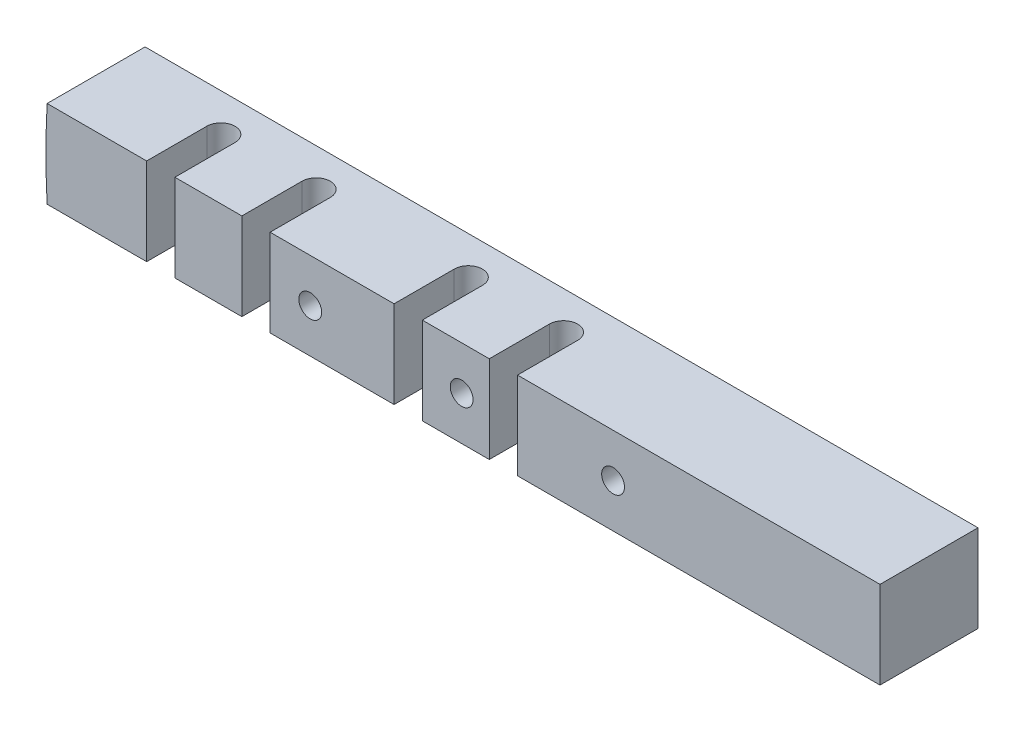
ISO-10303-21;
HEADER;
FILE_DESCRIPTION(('STEP AP214'),'2;1');
FILE_NAME('part.step','',(''),(''),'','','');
FILE_SCHEMA(('AUTOMOTIVE_DESIGN { 1 0 10303 214 1 1 1 1 }'));
ENDSEC;
DATA;
#1=APPLICATION_CONTEXT('core data for automotive mechanical design processes');
#2=APPLICATION_PROTOCOL_DEFINITION('international standard','automotive_design',2000,#1);
#3=PRODUCT_CONTEXT('',#1,'mechanical');
#4=PRODUCT('Part','Part','',(#3));
#5=PRODUCT_RELATED_PRODUCT_CATEGORY('part','',(#4));
#6=PRODUCT_DEFINITION_FORMATION('','',#4);
#7=PRODUCT_DEFINITION_CONTEXT('part definition',#1,'design');
#8=PRODUCT_DEFINITION('design','',#6,#7);
#9=PRODUCT_DEFINITION_SHAPE('','',#8);
#10=(LENGTH_UNIT() NAMED_UNIT(*) SI_UNIT(.MILLI.,.METRE.));
#11=(NAMED_UNIT(*) PLANE_ANGLE_UNIT() SI_UNIT($,.RADIAN.));
#12=(NAMED_UNIT(*) SI_UNIT($,.STERADIAN.) SOLID_ANGLE_UNIT());
#13=UNCERTAINTY_MEASURE_WITH_UNIT(LENGTH_MEASURE(1.E-05),#10,'distance_accuracy_value','');
#14=(GEOMETRIC_REPRESENTATION_CONTEXT(3) GLOBAL_UNCERTAINTY_ASSIGNED_CONTEXT((#13)) GLOBAL_UNIT_ASSIGNED_CONTEXT((#10,
#11,#12)) REPRESENTATION_CONTEXT('',''));
#15=CARTESIAN_POINT('',(0.,0.,0.));
#16=DIRECTION('',(0.,0.,1.));
#17=DIRECTION('',(1.,0.,0.));
#18=AXIS2_PLACEMENT_3D('',#15,#16,#17);
#19=CARTESIAN_POINT('',(7.49808000000001,4.318,13.97));
#20=DIRECTION('',(0.,-1.,0.));
#21=DIRECTION('',(1.,0.,0.));
#22=AXIS2_PLACEMENT_3D('',#19,#20,#21);
#23=PLANE('',#22);
#24=DIRECTION('',(0.,0.,-1.));
#25=VECTOR('',#24,1.);
#26=CARTESIAN_POINT('',(-75.8231481277321,4.31799999999999,13.97));
#27=LINE('',#26,#25);
#28=CARTESIAN_POINT('',(-75.8231481277321,4.31800000000002,9.69747570412176));
#29=VERTEX_POINT('',#28);
#30=CARTESIAN_POINT('',(-75.8231481277321,4.31799999999999,0.));
#31=VERTEX_POINT('',#30);
#32=EDGE_CURVE('E194',#29,#31,#27,.T.);
#33=ORIENTED_EDGE('',*,*,#32,.F.);
#34=DIRECTION('',(1.,0.,0.));
#35=VECTOR('',#34,1.);
#36=CARTESIAN_POINT('',(-87.3381097423243,4.31800000000002,9.69747570412176));
#37=LINE('',#36,#35);
#38=CARTESIAN_POINT('',(-65.97142,4.31800000000002,9.69747570412176));
#39=VERTEX_POINT('',#38);
#40=EDGE_CURVE('E170',#29,#39,#37,.T.);
#41=ORIENTED_EDGE('',*,*,#40,.T.);
#42=DIRECTION('',(0.,0.,-1.));
#43=VECTOR('',#42,1.);
#44=CARTESIAN_POINT('',(-65.97142,4.31800000000001,10.2235));
#45=LINE('',#44,#43);
#46=CARTESIAN_POINT('',(-65.97142,4.31800000000001,3.7465));
#47=VERTEX_POINT('',#46);
#48=EDGE_CURVE('E219',#39,#47,#45,.T.);
#49=ORIENTED_EDGE('',*,*,#48,.T.);
#50=CARTESIAN_POINT('',(-64.57442,4.31800000000001,3.7465));
#51=DIRECTION('',(0.,-1.,0.));
#52=DIRECTION('',(-1.,0.,0.));
#53=AXIS2_PLACEMENT_3D('',#50,#51,#52);
#54=CIRCLE('',#53,1.397);
#55=CARTESIAN_POINT('',(-63.17742,4.31800000000001,3.7465));
#56=VERTEX_POINT('',#55);
#57=EDGE_CURVE('E222',#47,#56,#54,.T.);
#58=ORIENTED_EDGE('',*,*,#57,.T.);
#59=DIRECTION('',(0.,0.,1.));
#60=VECTOR('',#59,1.);
#61=CARTESIAN_POINT('',(-63.17742,4.31800000000001,10.2235));
#62=LINE('',#61,#60);
#63=CARTESIAN_POINT('',(-63.17742,4.31800000000002,9.69747570412176));
#64=VERTEX_POINT('',#63);
#65=EDGE_CURVE('E230',#56,#64,#62,.T.);
#66=ORIENTED_EDGE('',*,*,#65,.T.);
#67=CARTESIAN_POINT('',(-56.54802,4.31800000000002,9.69747570412176));
#68=VERTEX_POINT('',#67);
#69=EDGE_CURVE('E377',#64,#68,#37,.T.);
#70=ORIENTED_EDGE('',*,*,#69,.T.);
#71=DIRECTION('',(0.,0.,-1.));
#72=VECTOR('',#71,1.);
#73=CARTESIAN_POINT('',(-56.54802,4.31800000000001,10.2235));
#74=LINE('',#73,#72);
#75=CARTESIAN_POINT('',(-56.54802,4.31800000000001,3.7465));
#76=VERTEX_POINT('',#75);
#77=EDGE_CURVE('E280',#68,#76,#74,.T.);
#78=ORIENTED_EDGE('',*,*,#77,.T.);
#79=CARTESIAN_POINT('',(-55.15102,4.31800000000001,3.7465));
#80=DIRECTION('',(0.,-1.,0.));
#81=DIRECTION('',(1.,0.,0.));
#82=AXIS2_PLACEMENT_3D('',#79,#80,#81);
#83=CIRCLE('',#82,1.397);
#84=CARTESIAN_POINT('',(-53.75402,4.31800000000001,3.7465));
#85=VERTEX_POINT('',#84);
#86=EDGE_CURVE('E285',#76,#85,#83,.T.);
#87=ORIENTED_EDGE('',*,*,#86,.T.);
#88=DIRECTION('',(0.,0.,1.));
#89=VECTOR('',#88,1.);
#90=CARTESIAN_POINT('',(-53.75402,4.31800000000001,10.2235));
#91=LINE('',#90,#89);
#92=CARTESIAN_POINT('',(-53.75402,4.31800000000001,9.69747570412176));
#93=VERTEX_POINT('',#92);
#94=EDGE_CURVE('E292',#85,#93,#91,.T.);
#95=ORIENTED_EDGE('',*,*,#94,.T.);
#96=CARTESIAN_POINT('',(-41.48582,4.31800000000002,9.69747570412176));
#97=VERTEX_POINT('',#96);
#98=EDGE_CURVE('E375',#93,#97,#37,.T.);
#99=ORIENTED_EDGE('',*,*,#98,.T.);
#100=DIRECTION('',(0.,0.,-1.));
#101=VECTOR('',#100,1.);
#102=CARTESIAN_POINT('',(-41.48582,4.31800000000001,10.2235));
#103=LINE('',#102,#101);
#104=CARTESIAN_POINT('',(-41.48582,4.31800000000001,3.7465));
#105=VERTEX_POINT('',#104);
#106=EDGE_CURVE('E259',#97,#105,#103,.T.);
#107=ORIENTED_EDGE('',*,*,#106,.T.);
#108=CARTESIAN_POINT('',(-40.08882,4.31800000000001,3.7465));
#109=DIRECTION('',(0.,-1.,0.));
#110=DIRECTION('',(-1.,0.,0.));
#111=AXIS2_PLACEMENT_3D('',#108,#109,#110);
#112=CIRCLE('',#111,1.397);
#113=CARTESIAN_POINT('',(-38.69182,4.31800000000001,3.7465));
#114=VERTEX_POINT('',#113);
#115=EDGE_CURVE('E264',#105,#114,#112,.T.);
#116=ORIENTED_EDGE('',*,*,#115,.T.);
#117=DIRECTION('',(0.,0.,1.));
#118=VECTOR('',#117,1.);
#119=CARTESIAN_POINT('',(-38.69182,4.31800000000001,10.2235));
#120=LINE('',#119,#118);
#121=CARTESIAN_POINT('',(-38.69182,4.31800000000001,9.69747570412176));
#122=VERTEX_POINT('',#121);
#123=EDGE_CURVE('E272',#114,#122,#120,.T.);
#124=ORIENTED_EDGE('',*,*,#123,.T.);
#125=CARTESIAN_POINT('',(-32.06242,4.31800000000001,9.69747570412176));
#126=VERTEX_POINT('',#125);
#127=EDGE_CURVE('E55',#122,#126,#37,.T.);
#128=ORIENTED_EDGE('',*,*,#127,.T.);
#129=DIRECTION('',(0.,0.,-1.));
#130=VECTOR('',#129,1.);
#131=CARTESIAN_POINT('',(-32.06242,4.31800000000001,10.2235));
#132=LINE('',#131,#130);
#133=CARTESIAN_POINT('',(-32.06242,4.318,3.7465));
#134=VERTEX_POINT('',#133);
#135=EDGE_CURVE('E243',#126,#134,#132,.T.);
#136=ORIENTED_EDGE('',*,*,#135,.T.);
#137=CARTESIAN_POINT('',(-30.66542,4.318,3.7465));
#138=DIRECTION('',(0.,-1.,0.));
#139=DIRECTION('',(1.,0.,0.));
#140=AXIS2_PLACEMENT_3D('',#137,#138,#139);
#141=CIRCLE('',#140,1.397);
#142=CARTESIAN_POINT('',(-29.26842,4.318,3.7465));
#143=VERTEX_POINT('',#142);
#144=EDGE_CURVE('E252',#134,#143,#141,.T.);
#145=ORIENTED_EDGE('',*,*,#144,.T.);
#146=DIRECTION('',(0.,0.,1.));
#147=VECTOR('',#146,1.);
#148=CARTESIAN_POINT('',(-29.26842,4.318,10.2235));
#149=LINE('',#148,#147);
#150=CARTESIAN_POINT('',(-29.26842,4.31800000000001,9.69747570412176));
#151=VERTEX_POINT('',#150);
#152=EDGE_CURVE('E238',#143,#151,#149,.T.);
#153=ORIENTED_EDGE('',*,*,#152,.T.);
#154=CARTESIAN_POINT('',(6.60400000000001,4.31800000000001,9.69747570412176));
#155=VERTEX_POINT('',#154);
#156=EDGE_CURVE('E186',#151,#155,#37,.T.);
#157=ORIENTED_EDGE('',*,*,#156,.T.);
#158=DIRECTION('',(0.,0.,-1.));
#159=VECTOR('',#158,1.);
#160=CARTESIAN_POINT('',(6.60400000000001,4.31800000000001,13.97));
#161=LINE('',#160,#159);
#162=CARTESIAN_POINT('',(6.60400000000001,4.31800000000001,0.));
#163=VERTEX_POINT('',#162);
#164=EDGE_CURVE('E206',#155,#163,#161,.T.);
#165=ORIENTED_EDGE('',*,*,#164,.T.);
#166=DIRECTION('',(-1.,0.,0.));
#167=VECTOR('',#166,1.);
#168=CARTESIAN_POINT('',(7.49808000000001,4.318,0.));
#169=LINE('',#168,#167);
#170=EDGE_CURVE('E209',#163,#31,#169,.T.);
#171=ORIENTED_EDGE('',*,*,#170,.T.);
#172=EDGE_LOOP('',(#33,#41,#49,#58,#66,#70,#78,#87,#95,#99,#107,#116,#124,#128,#136,#145,#153,
#157,#165,#171));
#173=FACE_BOUND('',#172,.T.);
#174=ADVANCED_FACE('F33',(#173),#23,.F.);
#175=CARTESIAN_POINT('',(0.,0.,13.97));
#176=DIRECTION('',(0.,0.,-1.));
#177=DIRECTION('',(-1.,0.,0.));
#178=AXIS2_PLACEMENT_3D('',#175,#176,#177);
#179=CYLINDRICAL_SURFACE('',#178,75.946);
#180=DIRECTION('',(0.,0.,-1.));
#181=VECTOR('',#180,1.);
#182=CARTESIAN_POINT('',(-75.8231481277321,-4.318,13.97));
#183=LINE('',#182,#181);
#184=CARTESIAN_POINT('',(-75.8231481277321,-4.31799999999999,9.69747570412176));
#185=VERTEX_POINT('',#184);
#186=CARTESIAN_POINT('',(-75.8231481277321,-4.318,0.));
#187=VERTEX_POINT('',#186);
#188=EDGE_CURVE('E182',#185,#187,#183,.T.);
#189=ORIENTED_EDGE('',*,*,#188,.F.);
#190=CARTESIAN_POINT('',(0.,0.,9.69747570412176));
#191=DIRECTION('',(0.,0.,-1.));
#192=DIRECTION('',(-1.,0.,0.));
#193=AXIS2_PLACEMENT_3D('',#190,#191,#192);
#194=CIRCLE('',#193,75.946);
#195=EDGE_CURVE('E167',#185,#29,#194,.T.);
#196=ORIENTED_EDGE('',*,*,#195,.T.);
#197=ORIENTED_EDGE('',*,*,#32,.T.);
#198=CARTESIAN_POINT('',(0.,0.,0.));
#199=DIRECTION('',(0.,0.,1.));
#200=DIRECTION('',(-1.,0.,0.));
#201=AXIS2_PLACEMENT_3D('',#198,#199,#200);
#202=CIRCLE('',#201,75.946);
#203=EDGE_CURVE('E192',#31,#187,#202,.T.);
#204=ORIENTED_EDGE('',*,*,#203,.T.);
#205=EDGE_LOOP('',(#189,#196,#197,#204));
#206=FACE_BOUND('',#205,.T.);
#207=ADVANCED_FACE('F190',(#206),#179,.T.);
#208=CARTESIAN_POINT('',(7.49808000000001,-4.318,13.97));
#209=DIRECTION('',(0.,1.,0.));
#210=DIRECTION('',(-1.,0.,0.));
#211=AXIS2_PLACEMENT_3D('',#208,#209,#210);
#212=PLANE('',#211);
#213=DIRECTION('',(0.,0.,-1.));
#214=VECTOR('',#213,1.);
#215=CARTESIAN_POINT('',(6.60400000000001,-4.318,13.97));
#216=LINE('',#215,#214);
#217=CARTESIAN_POINT('',(6.60400000000001,-4.318,9.69747570412176));
#218=VERTEX_POINT('',#217);
#219=CARTESIAN_POINT('',(6.60400000000001,-4.318,0.));
#220=VERTEX_POINT('',#219);
#221=EDGE_CURVE('E174',#218,#220,#216,.T.);
#222=ORIENTED_EDGE('',*,*,#221,.F.);
#223=DIRECTION('',(1.,0.,0.));
#224=VECTOR('',#223,1.);
#225=CARTESIAN_POINT('',(-87.3381097423243,-4.31799999999999,9.69747570412176));
#226=LINE('',#225,#224);
#227=CARTESIAN_POINT('',(-29.26842,-4.318,9.69747570412176));
#228=VERTEX_POINT('',#227);
#229=EDGE_CURVE('E189',#228,#218,#226,.T.);
#230=ORIENTED_EDGE('',*,*,#229,.F.);
#231=DIRECTION('',(0.,0.,1.));
#232=VECTOR('',#231,1.);
#233=CARTESIAN_POINT('',(-29.26842,-4.31799999999999,10.2235));
#234=LINE('',#233,#232);
#235=CARTESIAN_POINT('',(-29.26842,-4.31799999999999,3.7465));
#236=VERTEX_POINT('',#235);
#237=EDGE_CURVE('E240',#236,#228,#234,.T.);
#238=ORIENTED_EDGE('',*,*,#237,.F.);
#239=CARTESIAN_POINT('',(-30.66542,-4.31799999999999,3.7465));
#240=DIRECTION('',(0.,-1.,0.));
#241=DIRECTION('',(1.,0.,0.));
#242=AXIS2_PLACEMENT_3D('',#239,#240,#241);
#243=CIRCLE('',#242,1.397);
#244=CARTESIAN_POINT('',(-32.06242,-4.31799999999999,3.7465));
#245=VERTEX_POINT('',#244);
#246=EDGE_CURVE('E244',#245,#236,#243,.T.);
#247=ORIENTED_EDGE('',*,*,#246,.F.);
#248=DIRECTION('',(0.,0.,-1.));
#249=VECTOR('',#248,1.);
#250=CARTESIAN_POINT('',(-32.06242,-4.31799999999999,10.2235));
#251=LINE('',#250,#249);
#252=CARTESIAN_POINT('',(-32.06242,-4.318,9.69747570412176));
#253=VERTEX_POINT('',#252);
#254=EDGE_CURVE('E247',#253,#245,#251,.T.);
#255=ORIENTED_EDGE('',*,*,#254,.F.);
#256=CARTESIAN_POINT('',(-38.69182,-4.31799999999999,9.69747570412176));
#257=VERTEX_POINT('',#256);
#258=EDGE_CURVE('E320',#257,#253,#226,.T.);
#259=ORIENTED_EDGE('',*,*,#258,.F.);
#260=DIRECTION('',(0.,0.,1.));
#261=VECTOR('',#260,1.);
#262=CARTESIAN_POINT('',(-38.69182,-4.31799999999999,10.2235));
#263=LINE('',#262,#261);
#264=CARTESIAN_POINT('',(-38.69182,-4.31799999999999,3.7465));
#265=VERTEX_POINT('',#264);
#266=EDGE_CURVE('E265',#265,#257,#263,.T.);
#267=ORIENTED_EDGE('',*,*,#266,.F.);
#268=CARTESIAN_POINT('',(-40.08882,-4.31799999999999,3.7465));
#269=DIRECTION('',(0.,-1.,0.));
#270=DIRECTION('',(-1.,0.,0.));
#271=AXIS2_PLACEMENT_3D('',#268,#269,#270);
#272=CIRCLE('',#271,1.397);
#273=CARTESIAN_POINT('',(-41.48582,-4.31799999999999,3.7465));
#274=VERTEX_POINT('',#273);
#275=EDGE_CURVE('E268',#274,#265,#272,.T.);
#276=ORIENTED_EDGE('',*,*,#275,.F.);
#277=DIRECTION('',(0.,0.,-1.));
#278=VECTOR('',#277,1.);
#279=CARTESIAN_POINT('',(-41.48582,-4.31799999999999,10.2235));
#280=LINE('',#279,#278);
#281=CARTESIAN_POINT('',(-41.48582,-4.31799999999999,9.69747570412176));
#282=VERTEX_POINT('',#281);
#283=EDGE_CURVE('E262',#282,#274,#280,.T.);
#284=ORIENTED_EDGE('',*,*,#283,.F.);
#285=CARTESIAN_POINT('',(-53.75402,-4.31799999999999,9.69747570412176));
#286=VERTEX_POINT('',#285);
#287=EDGE_CURVE('E396',#286,#282,#226,.T.);
#288=ORIENTED_EDGE('',*,*,#287,.F.);
#289=DIRECTION('',(0.,0.,1.));
#290=VECTOR('',#289,1.);
#291=CARTESIAN_POINT('',(-53.75402,-4.31799999999999,10.2235));
#292=LINE('',#291,#290);
#293=CARTESIAN_POINT('',(-53.75402,-4.31799999999999,3.7465));
#294=VERTEX_POINT('',#293);
#295=EDGE_CURVE('E286',#294,#286,#292,.T.);
#296=ORIENTED_EDGE('',*,*,#295,.F.);
#297=CARTESIAN_POINT('',(-55.15102,-4.31799999999999,3.7465));
#298=DIRECTION('',(0.,-1.,0.));
#299=DIRECTION('',(1.,0.,0.));
#300=AXIS2_PLACEMENT_3D('',#297,#298,#299);
#301=CIRCLE('',#300,1.397);
#302=CARTESIAN_POINT('',(-56.54802,-4.31799999999999,3.7465));
#303=VERTEX_POINT('',#302);
#304=EDGE_CURVE('E289',#303,#294,#301,.T.);
#305=ORIENTED_EDGE('',*,*,#304,.F.);
#306=DIRECTION('',(0.,0.,-1.));
#307=VECTOR('',#306,1.);
#308=CARTESIAN_POINT('',(-56.54802,-4.31799999999999,10.2235));
#309=LINE('',#308,#307);
#310=CARTESIAN_POINT('',(-56.54802,-4.31799999999999,9.69747570412176));
#311=VERTEX_POINT('',#310);
#312=EDGE_CURVE('E283',#311,#303,#309,.T.);
#313=ORIENTED_EDGE('',*,*,#312,.F.);
#314=CARTESIAN_POINT('',(-63.17742,-4.31799999999999,9.69747570412176));
#315=VERTEX_POINT('',#314);
#316=EDGE_CURVE('E187',#315,#311,#226,.T.);
#317=ORIENTED_EDGE('',*,*,#316,.F.);
#318=DIRECTION('',(0.,0.,1.));
#319=VECTOR('',#318,1.);
#320=CARTESIAN_POINT('',(-63.17742,-4.31799999999999,10.2235));
#321=LINE('',#320,#319);
#322=CARTESIAN_POINT('',(-63.17742,-4.31799999999999,3.7465));
#323=VERTEX_POINT('',#322);
#324=EDGE_CURVE('E223',#323,#315,#321,.T.);
#325=ORIENTED_EDGE('',*,*,#324,.F.);
#326=CARTESIAN_POINT('',(-64.57442,-4.31799999999999,3.7465));
#327=DIRECTION('',(0.,-1.,0.));
#328=DIRECTION('',(-1.,0.,0.));
#329=AXIS2_PLACEMENT_3D('',#326,#327,#328);
#330=CIRCLE('',#329,1.397);
#331=CARTESIAN_POINT('',(-65.97142,-4.31799999999999,3.7465));
#332=VERTEX_POINT('',#331);
#333=EDGE_CURVE('E226',#332,#323,#330,.T.);
#334=ORIENTED_EDGE('',*,*,#333,.F.);
#335=DIRECTION('',(0.,0.,-1.));
#336=VECTOR('',#335,1.);
#337=CARTESIAN_POINT('',(-65.97142,-4.31799999999999,10.2235));
#338=LINE('',#337,#336);
#339=CARTESIAN_POINT('',(-65.97142,-4.31799999999999,9.69747570412176));
#340=VERTEX_POINT('',#339);
#341=EDGE_CURVE('E185',#340,#332,#338,.T.);
#342=ORIENTED_EDGE('',*,*,#341,.F.);
#343=EDGE_CURVE('E47',#185,#340,#226,.T.);
#344=ORIENTED_EDGE('',*,*,#343,.F.);
#345=ORIENTED_EDGE('',*,*,#188,.T.);
#346=DIRECTION('',(1.,0.,0.));
#347=VECTOR('',#346,1.);
#348=CARTESIAN_POINT('',(7.49808000000001,-4.318,0.));
#349=LINE('',#348,#347);
#350=EDGE_CURVE('E195',#187,#220,#349,.T.);
#351=ORIENTED_EDGE('',*,*,#350,.T.);
#352=EDGE_LOOP('',(#222,#230,#238,#247,#255,#259,#267,#276,#284,#288,#296,#305,#313,#317,#325,
#334,#342,#344,#345,#351));
#353=FACE_BOUND('',#352,.T.);
#354=ADVANCED_FACE('F180',(#353),#212,.F.);
#355=CARTESIAN_POINT('',(0.,0.,0.));
#356=DIRECTION('',(0.,0.,-1.));
#357=DIRECTION('',(-1.,0.,0.));
#358=AXIS2_PLACEMENT_3D('',#355,#356,#357);
#359=PLANE('',#358);
#360=DIRECTION('',(0.,1.,0.));
#361=VECTOR('',#360,1.);
#362=CARTESIAN_POINT('',(6.60400000000001,0.,0.));
#363=LINE('',#362,#361);
#364=EDGE_CURVE('E40',#220,#163,#363,.T.);
#365=ORIENTED_EDGE('',*,*,#364,.F.);
#366=ORIENTED_EDGE('',*,*,#350,.F.);
#367=ORIENTED_EDGE('',*,*,#203,.F.);
#368=ORIENTED_EDGE('',*,*,#170,.F.);
#369=EDGE_LOOP('',(#365,#366,#367,#368));
#370=FACE_BOUND('',#369,.T.);
#371=ADVANCED_FACE('F210',(#370),#359,.T.);
#372=CARTESIAN_POINT('',(-64.57442,4.31800000000001,3.7465));
#373=DIRECTION('',(0.,-1.,0.));
#374=DIRECTION('',(1.,0.,0.));
#375=AXIS2_PLACEMENT_3D('',#372,#373,#374);
#376=CYLINDRICAL_SURFACE('',#375,1.397);
#377=ORIENTED_EDGE('',*,*,#333,.T.);
#378=DIRECTION('',(0.,-1.,0.));
#379=VECTOR('',#378,1.);
#380=CARTESIAN_POINT('',(-63.17742,4.31800000000001,3.7465));
#381=LINE('',#380,#379);
#382=EDGE_CURVE('E215',#56,#323,#381,.T.);
#383=ORIENTED_EDGE('',*,*,#382,.F.);
#384=ORIENTED_EDGE('',*,*,#57,.F.);
#385=DIRECTION('',(0.,-1.,0.));
#386=VECTOR('',#385,1.);
#387=CARTESIAN_POINT('',(-65.97142,4.31800000000001,3.7465));
#388=LINE('',#387,#386);
#389=EDGE_CURVE('E212',#47,#332,#388,.T.);
#390=ORIENTED_EDGE('',*,*,#389,.T.);
#391=EDGE_LOOP('',(#377,#383,#384,#390));
#392=FACE_BOUND('',#391,.T.);
#393=ADVANCED_FACE('F387',(#392),#376,.F.);
#394=CARTESIAN_POINT('',(-65.97142,4.31800000000001,10.2235));
#395=DIRECTION('',(-1.,0.,0.));
#396=DIRECTION('',(0.,-1.,0.));
#397=AXIS2_PLACEMENT_3D('',#394,#395,#396);
#398=PLANE('',#397);
#399=ORIENTED_EDGE('',*,*,#48,.F.);
#400=DIRECTION('',(0.,-1.,0.));
#401=VECTOR('',#400,1.);
#402=CARTESIAN_POINT('',(-65.97142,4.31800000000001,9.69747570412176));
#403=LINE('',#402,#401);
#404=EDGE_CURVE('E175',#39,#340,#403,.T.);
#405=ORIENTED_EDGE('',*,*,#404,.T.);
#406=ORIENTED_EDGE('',*,*,#341,.T.);
#407=ORIENTED_EDGE('',*,*,#389,.F.);
#408=EDGE_LOOP('',(#399,#405,#406,#407));
#409=FACE_BOUND('',#408,.T.);
#410=ADVANCED_FACE('F384',(#409),#398,.F.);
#411=CARTESIAN_POINT('',(-63.17742,4.31800000000001,10.2235));
#412=DIRECTION('',(1.,0.,0.));
#413=DIRECTION('',(0.,0.,-1.));
#414=AXIS2_PLACEMENT_3D('',#411,#412,#413);
#415=PLANE('',#414);
#416=ORIENTED_EDGE('',*,*,#324,.T.);
#417=DIRECTION('',(0.,1.,0.));
#418=VECTOR('',#417,1.);
#419=CARTESIAN_POINT('',(-63.17742,4.31800000000001,9.69747570412176));
#420=LINE('',#419,#418);
#421=EDGE_CURVE('E300',#315,#64,#420,.T.);
#422=ORIENTED_EDGE('',*,*,#421,.T.);
#423=ORIENTED_EDGE('',*,*,#65,.F.);
#424=ORIENTED_EDGE('',*,*,#382,.T.);
#425=EDGE_LOOP('',(#416,#422,#423,#424));
#426=FACE_BOUND('',#425,.T.);
#427=ADVANCED_FACE('F390',(#426),#415,.F.);
#428=CARTESIAN_POINT('',(-29.26842,4.318,10.2235));
#429=DIRECTION('',(1.,0.,0.));
#430=DIRECTION('',(0.,1.,0.));
#431=AXIS2_PLACEMENT_3D('',#428,#429,#430);
#432=PLANE('',#431);
#433=ORIENTED_EDGE('',*,*,#237,.T.);
#434=DIRECTION('',(0.,1.,0.));
#435=VECTOR('',#434,1.);
#436=CARTESIAN_POINT('',(-29.26842,4.318,9.69747570412176));
#437=LINE('',#436,#435);
#438=EDGE_CURVE('E303',#228,#151,#437,.T.);
#439=ORIENTED_EDGE('',*,*,#438,.T.);
#440=ORIENTED_EDGE('',*,*,#152,.F.);
#441=DIRECTION('',(0.,-1.,0.));
#442=VECTOR('',#441,1.);
#443=CARTESIAN_POINT('',(-29.26842,4.318,3.7465));
#444=LINE('',#443,#442);
#445=EDGE_CURVE('E228',#143,#236,#444,.T.);
#446=ORIENTED_EDGE('',*,*,#445,.T.);
#447=EDGE_LOOP('',(#433,#439,#440,#446));
#448=FACE_BOUND('',#447,.T.);
#449=ADVANCED_FACE('F362',(#448),#432,.F.);
#450=CARTESIAN_POINT('',(-30.66542,4.318,3.7465));
#451=DIRECTION('',(0.,-1.,0.));
#452=DIRECTION('',(1.,0.,0.));
#453=AXIS2_PLACEMENT_3D('',#450,#451,#452);
#454=CYLINDRICAL_SURFACE('',#453,1.397);
#455=ORIENTED_EDGE('',*,*,#246,.T.);
#456=ORIENTED_EDGE('',*,*,#445,.F.);
#457=ORIENTED_EDGE('',*,*,#144,.F.);
#458=DIRECTION('',(0.,-1.,0.));
#459=VECTOR('',#458,1.);
#460=CARTESIAN_POINT('',(-32.06242,4.318,3.7465));
#461=LINE('',#460,#459);
#462=EDGE_CURVE('E235',#134,#245,#461,.T.);
#463=ORIENTED_EDGE('',*,*,#462,.T.);
#464=EDGE_LOOP('',(#455,#456,#457,#463));
#465=FACE_BOUND('',#464,.T.);
#466=ADVANCED_FACE('F366',(#465),#454,.F.);
#467=CARTESIAN_POINT('',(-32.06242,4.31800000000001,10.2235));
#468=DIRECTION('',(-1.,0.,0.));
#469=DIRECTION('',(0.,0.,1.));
#470=AXIS2_PLACEMENT_3D('',#467,#468,#469);
#471=PLANE('',#470);
#472=ORIENTED_EDGE('',*,*,#135,.F.);
#473=DIRECTION('',(0.,-1.,0.));
#474=VECTOR('',#473,1.);
#475=CARTESIAN_POINT('',(-32.06242,4.31800000000001,9.69747570412176));
#476=LINE('',#475,#474);
#477=EDGE_CURVE('E306',#126,#253,#476,.T.);
#478=ORIENTED_EDGE('',*,*,#477,.T.);
#479=ORIENTED_EDGE('',*,*,#254,.T.);
#480=ORIENTED_EDGE('',*,*,#462,.F.);
#481=EDGE_LOOP('',(#472,#478,#479,#480));
#482=FACE_BOUND('',#481,.T.);
#483=ADVANCED_FACE('F373',(#482),#471,.F.);
#484=CARTESIAN_POINT('',(-40.08882,4.31800000000001,3.7465));
#485=DIRECTION('',(0.,-1.,0.));
#486=DIRECTION('',(1.,0.,0.));
#487=AXIS2_PLACEMENT_3D('',#484,#485,#486);
#488=CYLINDRICAL_SURFACE('',#487,1.397);
#489=ORIENTED_EDGE('',*,*,#275,.T.);
#490=DIRECTION('',(0.,-1.,0.));
#491=VECTOR('',#490,1.);
#492=CARTESIAN_POINT('',(-38.69182,4.31800000000001,3.7465));
#493=LINE('',#492,#491);
#494=EDGE_CURVE('E256',#114,#265,#493,.T.);
#495=ORIENTED_EDGE('',*,*,#494,.F.);
#496=ORIENTED_EDGE('',*,*,#115,.F.);
#497=DIRECTION('',(0.,-1.,0.));
#498=VECTOR('',#497,1.);
#499=CARTESIAN_POINT('',(-41.48582,4.31800000000001,3.7465));
#500=LINE('',#499,#498);
#501=EDGE_CURVE('E249',#105,#274,#500,.T.);
#502=ORIENTED_EDGE('',*,*,#501,.T.);
#503=EDGE_LOOP('',(#489,#495,#496,#502));
#504=FACE_BOUND('',#503,.T.);
#505=ADVANCED_FACE('F406',(#504),#488,.F.);
#506=CARTESIAN_POINT('',(-41.48582,4.31800000000001,10.2235));
#507=DIRECTION('',(-1.,0.,0.));
#508=DIRECTION('',(0.,-1.,0.));
#509=AXIS2_PLACEMENT_3D('',#506,#507,#508);
#510=PLANE('',#509);
#511=ORIENTED_EDGE('',*,*,#106,.F.);
#512=DIRECTION('',(0.,-1.,0.));
#513=VECTOR('',#512,1.);
#514=CARTESIAN_POINT('',(-41.48582,4.31800000000001,9.69747570412176));
#515=LINE('',#514,#513);
#516=EDGE_CURVE('E309',#97,#282,#515,.T.);
#517=ORIENTED_EDGE('',*,*,#516,.T.);
#518=ORIENTED_EDGE('',*,*,#283,.T.);
#519=ORIENTED_EDGE('',*,*,#501,.F.);
#520=EDGE_LOOP('',(#511,#517,#518,#519));
#521=FACE_BOUND('',#520,.T.);
#522=ADVANCED_FACE('F402',(#521),#510,.F.);
#523=CARTESIAN_POINT('',(-38.69182,4.31800000000001,10.2235));
#524=DIRECTION('',(1.,0.,0.));
#525=DIRECTION('',(0.,0.,-1.));
#526=AXIS2_PLACEMENT_3D('',#523,#524,#525);
#527=PLANE('',#526);
#528=ORIENTED_EDGE('',*,*,#266,.T.);
#529=DIRECTION('',(0.,1.,0.));
#530=VECTOR('',#529,1.);
#531=CARTESIAN_POINT('',(-38.69182,4.31800000000001,9.69747570412176));
#532=LINE('',#531,#530);
#533=EDGE_CURVE('E312',#257,#122,#532,.T.);
#534=ORIENTED_EDGE('',*,*,#533,.T.);
#535=ORIENTED_EDGE('',*,*,#123,.F.);
#536=ORIENTED_EDGE('',*,*,#494,.T.);
#537=EDGE_LOOP('',(#528,#534,#535,#536));
#538=FACE_BOUND('',#537,.T.);
#539=ADVANCED_FACE('F409',(#538),#527,.F.);
#540=CARTESIAN_POINT('',(-55.15102,4.31800000000001,3.7465));
#541=DIRECTION('',(0.,-1.,0.));
#542=DIRECTION('',(1.,0.,0.));
#543=AXIS2_PLACEMENT_3D('',#540,#541,#542);
#544=CYLINDRICAL_SURFACE('',#543,1.397);
#545=ORIENTED_EDGE('',*,*,#304,.T.);
#546=DIRECTION('',(0.,-1.,0.));
#547=VECTOR('',#546,1.);
#548=CARTESIAN_POINT('',(-53.75402,4.31800000000001,3.7465));
#549=LINE('',#548,#547);
#550=EDGE_CURVE('E277',#85,#294,#549,.T.);
#551=ORIENTED_EDGE('',*,*,#550,.F.);
#552=ORIENTED_EDGE('',*,*,#86,.F.);
#553=DIRECTION('',(0.,-1.,0.));
#554=VECTOR('',#553,1.);
#555=CARTESIAN_POINT('',(-56.54802,4.31800000000001,3.7465));
#556=LINE('',#555,#554);
#557=EDGE_CURVE('E270',#76,#303,#556,.T.);
#558=ORIENTED_EDGE('',*,*,#557,.T.);
#559=EDGE_LOOP('',(#545,#551,#552,#558));
#560=FACE_BOUND('',#559,.T.);
#561=ADVANCED_FACE('F411',(#560),#544,.F.);
#562=CARTESIAN_POINT('',(-56.54802,4.31800000000001,10.2235));
#563=DIRECTION('',(-1.,0.,0.));
#564=DIRECTION('',(0.,0.,1.));
#565=AXIS2_PLACEMENT_3D('',#562,#563,#564);
#566=PLANE('',#565);
#567=ORIENTED_EDGE('',*,*,#77,.F.);
#568=DIRECTION('',(0.,-1.,0.));
#569=VECTOR('',#568,1.);
#570=CARTESIAN_POINT('',(-56.54802,4.31800000000001,9.69747570412176));
#571=LINE('',#570,#569);
#572=EDGE_CURVE('E314',#68,#311,#571,.T.);
#573=ORIENTED_EDGE('',*,*,#572,.T.);
#574=ORIENTED_EDGE('',*,*,#312,.T.);
#575=ORIENTED_EDGE('',*,*,#557,.F.);
#576=EDGE_LOOP('',(#567,#573,#574,#575));
#577=FACE_BOUND('',#576,.T.);
#578=ADVANCED_FACE('F417',(#577),#566,.F.);
#579=CARTESIAN_POINT('',(-53.75402,4.31800000000001,10.2235));
#580=DIRECTION('',(1.,0.,0.));
#581=DIRECTION('',(0.,1.,0.));
#582=AXIS2_PLACEMENT_3D('',#579,#580,#581);
#583=PLANE('',#582);
#584=ORIENTED_EDGE('',*,*,#295,.T.);
#585=DIRECTION('',(0.,1.,0.));
#586=VECTOR('',#585,1.);
#587=CARTESIAN_POINT('',(-53.75402,4.31800000000001,9.69747570412176));
#588=LINE('',#587,#586);
#589=EDGE_CURVE('E317',#286,#93,#588,.T.);
#590=ORIENTED_EDGE('',*,*,#589,.T.);
#591=ORIENTED_EDGE('',*,*,#94,.F.);
#592=ORIENTED_EDGE('',*,*,#550,.T.);
#593=EDGE_LOOP('',(#584,#590,#591,#592));
#594=FACE_BOUND('',#593,.T.);
#595=ADVANCED_FACE('F472',(#594),#583,.F.);
#596=CARTESIAN_POINT('',(6.60400000000001,4.31800000000001,13.97));
#597=DIRECTION('',(-1.,0.,0.));
#598=DIRECTION('',(0.,-1.,0.));
#599=AXIS2_PLACEMENT_3D('',#596,#597,#598);
#600=PLANE('',#599);
#601=ORIENTED_EDGE('',*,*,#164,.F.);
#602=DIRECTION('',(0.,-1.,0.));
#603=VECTOR('',#602,1.);
#604=CARTESIAN_POINT('',(6.60400000000001,4.31800000000001,9.69747570412176));
#605=LINE('',#604,#603);
#606=EDGE_CURVE('E11',#155,#218,#605,.T.);
#607=ORIENTED_EDGE('',*,*,#606,.T.);
#608=ORIENTED_EDGE('',*,*,#221,.T.);
#609=ORIENTED_EDGE('',*,*,#364,.T.);
#610=EDGE_LOOP('',(#601,#607,#608,#609));
#611=FACE_BOUND('',#610,.T.);
#612=ADVANCED_FACE('F205',(#611),#600,.F.);
#613=CARTESIAN_POINT('',(-87.3381097423243,4.31800000000002,9.69747570412176));
#614=DIRECTION('',(0.,0.,-1.));
#615=DIRECTION('',(-1.,0.,0.));
#616=AXIS2_PLACEMENT_3D('',#613,#614,#615);
#617=PLANE('',#616);
#618=CARTESIAN_POINT('',(-19.812,0.,9.69747570412176));
#619=DIRECTION('',(0.,0.,1.));
#620=DIRECTION('',(1.,0.,0.));
#621=AXIS2_PLACEMENT_3D('',#618,#619,#620);
#622=CIRCLE('',#621,1.1303);
#623=CARTESIAN_POINT('',(-18.6817,0.,9.69747570412176));
#624=VERTEX_POINT('',#623);
#625=EDGE_CURVE('E336',#624,#624,#622,.T.);
#626=ORIENTED_EDGE('',*,*,#625,.F.);
#627=EDGE_LOOP('',(#626));
#628=FACE_BOUND('',#627,.T.);
#629=ORIENTED_EDGE('',*,*,#229,.T.);
#630=ORIENTED_EDGE('',*,*,#606,.F.);
#631=ORIENTED_EDGE('',*,*,#156,.F.);
#632=ORIENTED_EDGE('',*,*,#438,.F.);
#633=EDGE_LOOP('',(#629,#630,#631,#632));
#634=FACE_BOUND('',#633,.T.);
#635=ADVANCED_FACE('F351',(#628,#634),#617,.F.);
#636=CARTESIAN_POINT('',(-49.784,0.,9.69747570412176));
#637=DIRECTION('',(0.,0.,1.));
#638=DIRECTION('',(1.,0.,0.));
#639=AXIS2_PLACEMENT_3D('',#636,#637,#638);
#640=CIRCLE('',#639,1.1303);
#641=CARTESIAN_POINT('',(-48.6537,0.,9.69747570412176));
#642=VERTEX_POINT('',#641);
#643=EDGE_CURVE('E324',#642,#642,#640,.T.);
#644=ORIENTED_EDGE('',*,*,#643,.F.);
#645=EDGE_LOOP('',(#644));
#646=FACE_BOUND('',#645,.T.);
#647=ORIENTED_EDGE('',*,*,#98,.F.);
#648=ORIENTED_EDGE('',*,*,#589,.F.);
#649=ORIENTED_EDGE('',*,*,#287,.T.);
#650=ORIENTED_EDGE('',*,*,#516,.F.);
#651=EDGE_LOOP('',(#647,#648,#649,#650));
#652=FACE_BOUND('',#651,.T.);
#653=ADVANCED_FACE('F354',(#646,#652),#617,.F.);
#654=ORIENTED_EDGE('',*,*,#316,.T.);
#655=ORIENTED_EDGE('',*,*,#572,.F.);
#656=ORIENTED_EDGE('',*,*,#69,.F.);
#657=ORIENTED_EDGE('',*,*,#421,.F.);
#658=EDGE_LOOP('',(#654,#655,#656,#657));
#659=FACE_BOUND('',#658,.T.);
#660=ADVANCED_FACE('F357',(#659),#617,.F.);
#661=CARTESIAN_POINT('',(-34.798,0.,9.69747570412176));
#662=DIRECTION('',(0.,0.,1.));
#663=DIRECTION('',(1.,0.,0.));
#664=AXIS2_PLACEMENT_3D('',#661,#662,#663);
#665=CIRCLE('',#664,1.1303);
#666=CARTESIAN_POINT('',(-33.6677,0.,9.69747570412176));
#667=VERTEX_POINT('',#666);
#668=EDGE_CURVE('E330',#667,#667,#665,.T.);
#669=ORIENTED_EDGE('',*,*,#668,.F.);
#670=EDGE_LOOP('',(#669));
#671=FACE_BOUND('',#670,.T.);
#672=ORIENTED_EDGE('',*,*,#127,.F.);
#673=ORIENTED_EDGE('',*,*,#533,.F.);
#674=ORIENTED_EDGE('',*,*,#258,.T.);
#675=ORIENTED_EDGE('',*,*,#477,.F.);
#676=EDGE_LOOP('',(#672,#673,#674,#675));
#677=FACE_BOUND('',#676,.T.);
#678=ADVANCED_FACE('F356',(#671,#677),#617,.F.);
#679=ORIENTED_EDGE('',*,*,#343,.T.);
#680=ORIENTED_EDGE('',*,*,#404,.F.);
#681=ORIENTED_EDGE('',*,*,#40,.F.);
#682=ORIENTED_EDGE('',*,*,#195,.F.);
#683=EDGE_LOOP('',(#679,#680,#681,#682));
#684=FACE_BOUND('',#683,.T.);
#685=ADVANCED_FACE('F168',(#684),#617,.F.);
#686=CARTESIAN_POINT('',(-49.784,0.,4.61747570412176));
#687=DIRECTION('',(0.,0.,1.));
#688=DIRECTION('',(1.,0.,0.));
#689=AXIS2_PLACEMENT_3D('',#686,#687,#688);
#690=CYLINDRICAL_SURFACE('',#689,1.1303);
#691=CARTESIAN_POINT('',(-49.784,0.,4.61747570412176));
#692=DIRECTION('',(0.,0.,1.));
#693=DIRECTION('',(1.,0.,0.));
#694=AXIS2_PLACEMENT_3D('',#691,#692,#693);
#695=CIRCLE('',#694,1.1303);
#696=CARTESIAN_POINT('',(-48.6537,0.,4.61747570412176));
#697=VERTEX_POINT('',#696);
#698=EDGE_CURVE('E321',#697,#697,#695,.T.);
#699=ORIENTED_EDGE('',*,*,#698,.F.);
#700=EDGE_LOOP('',(#699));
#701=FACE_BOUND('',#700,.T.);
#702=ORIENTED_EDGE('',*,*,#643,.T.);
#703=EDGE_LOOP('',(#702));
#704=FACE_BOUND('',#703,.T.);
#705=ADVANCED_FACE('F511',(#701,#704),#690,.F.);
#706=CARTESIAN_POINT('',(-49.784,0.,4.61747570412176));
#707=DIRECTION('',(0.,0.,1.));
#708=DIRECTION('',(1.,0.,0.));
#709=AXIS2_PLACEMENT_3D('',#706,#707,#708);
#710=PLANE('',#709);
#711=ORIENTED_EDGE('',*,*,#698,.T.);
#712=EDGE_LOOP('',(#711));
#713=FACE_BOUND('',#712,.T.);
#714=ADVANCED_FACE('F536',(#713),#710,.T.);
#715=CARTESIAN_POINT('',(-34.798,0.,4.61747570412176));
#716=DIRECTION('',(0.,0.,1.));
#717=DIRECTION('',(1.,0.,0.));
#718=AXIS2_PLACEMENT_3D('',#715,#716,#717);
#719=CYLINDRICAL_SURFACE('',#718,1.1303);
#720=CARTESIAN_POINT('',(-34.798,0.,4.61747570412176));
#721=DIRECTION('',(0.,0.,1.));
#722=DIRECTION('',(1.,0.,0.));
#723=AXIS2_PLACEMENT_3D('',#720,#721,#722);
#724=CIRCLE('',#723,1.1303);
#725=CARTESIAN_POINT('',(-33.6677,0.,4.61747570412176));
#726=VERTEX_POINT('',#725);
#727=EDGE_CURVE('E327',#726,#726,#724,.T.);
#728=ORIENTED_EDGE('',*,*,#727,.F.);
#729=EDGE_LOOP('',(#728));
#730=FACE_BOUND('',#729,.T.);
#731=ORIENTED_EDGE('',*,*,#668,.T.);
#732=EDGE_LOOP('',(#731));
#733=FACE_BOUND('',#732,.T.);
#734=ADVANCED_FACE('F546',(#730,#733),#719,.F.);
#735=CARTESIAN_POINT('',(-34.798,0.,4.61747570412176));
#736=DIRECTION('',(0.,0.,1.));
#737=DIRECTION('',(1.,0.,0.));
#738=AXIS2_PLACEMENT_3D('',#735,#736,#737);
#739=PLANE('',#738);
#740=ORIENTED_EDGE('',*,*,#727,.T.);
#741=EDGE_LOOP('',(#740));
#742=FACE_BOUND('',#741,.T.);
#743=ADVANCED_FACE('F347',(#742),#739,.T.);
#744=CARTESIAN_POINT('',(-19.812,0.,4.61747570412176));
#745=DIRECTION('',(0.,0.,1.));
#746=DIRECTION('',(1.,0.,0.));
#747=AXIS2_PLACEMENT_3D('',#744,#745,#746);
#748=CYLINDRICAL_SURFACE('',#747,1.1303);
#749=CARTESIAN_POINT('',(-19.812,0.,4.61747570412176));
#750=DIRECTION('',(0.,0.,1.));
#751=DIRECTION('',(1.,0.,0.));
#752=AXIS2_PLACEMENT_3D('',#749,#750,#751);
#753=CIRCLE('',#752,1.1303);
#754=CARTESIAN_POINT('',(-18.6817,0.,4.61747570412176));
#755=VERTEX_POINT('',#754);
#756=EDGE_CURVE('E333',#755,#755,#753,.T.);
#757=ORIENTED_EDGE('',*,*,#756,.F.);
#758=EDGE_LOOP('',(#757));
#759=FACE_BOUND('',#758,.T.);
#760=ORIENTED_EDGE('',*,*,#625,.T.);
#761=EDGE_LOOP('',(#760));
#762=FACE_BOUND('',#761,.T.);
#763=ADVANCED_FACE('F344',(#759,#762),#748,.F.);
#764=CARTESIAN_POINT('',(-19.812,0.,4.61747570412176));
#765=DIRECTION('',(0.,0.,1.));
#766=DIRECTION('',(1.,0.,0.));
#767=AXIS2_PLACEMENT_3D('',#764,#765,#766);
#768=PLANE('',#767);
#769=ORIENTED_EDGE('',*,*,#756,.T.);
#770=EDGE_LOOP('',(#769));
#771=FACE_BOUND('',#770,.T.);
#772=ADVANCED_FACE('F342',(#771),#768,.T.);
#773=CLOSED_SHELL('',(#174,#207,#354,#371,#393,#410,#427,#449,#466,#483,#505,#522,#539,#561,
#578,#595,#612,#635,#653,#660,#678,#685,#705,#714,#734,#743,#763,#772));
#774=MANIFOLD_SOLID_BREP('B2',#773);
#775=ADVANCED_BREP_SHAPE_REPRESENTATION('',(#18,#774),#14);
#776=SHAPE_DEFINITION_REPRESENTATION(#9,#775);
ENDSEC;
END-ISO-10303-21;
